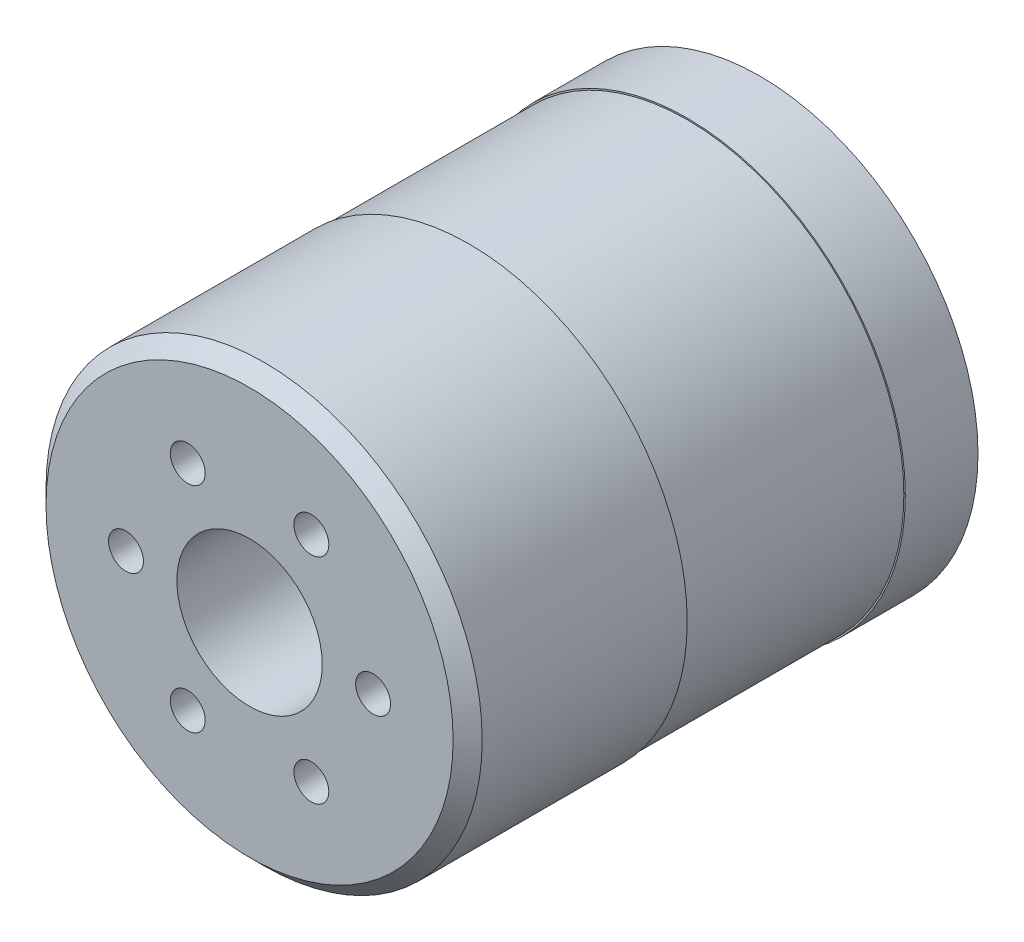
ISO-10303-21;
HEADER;
FILE_DESCRIPTION(('STEP AP214'),'2;1');
FILE_NAME('part.step','',(''),(''),'','','');
FILE_SCHEMA(('AUTOMOTIVE_DESIGN { 1 0 10303 214 1 1 1 1 }'));
ENDSEC;
DATA;
#1=APPLICATION_CONTEXT('core data for automotive mechanical design processes');
#2=APPLICATION_PROTOCOL_DEFINITION('international standard','automotive_design',2000,#1);
#3=PRODUCT_CONTEXT('',#1,'mechanical');
#4=PRODUCT('Part','Part','',(#3));
#5=PRODUCT_RELATED_PRODUCT_CATEGORY('part','',(#4));
#6=PRODUCT_DEFINITION_FORMATION('','',#4);
#7=PRODUCT_DEFINITION_CONTEXT('part definition',#1,'design');
#8=PRODUCT_DEFINITION('design','',#6,#7);
#9=PRODUCT_DEFINITION_SHAPE('','',#8);
#10=(LENGTH_UNIT() NAMED_UNIT(*) SI_UNIT(.MILLI.,.METRE.));
#11=(NAMED_UNIT(*) PLANE_ANGLE_UNIT() SI_UNIT($,.RADIAN.));
#12=(NAMED_UNIT(*) SI_UNIT($,.STERADIAN.) SOLID_ANGLE_UNIT());
#13=UNCERTAINTY_MEASURE_WITH_UNIT(LENGTH_MEASURE(1.E-05),#10,'distance_accuracy_value','');
#14=(GEOMETRIC_REPRESENTATION_CONTEXT(3) GLOBAL_UNCERTAINTY_ASSIGNED_CONTEXT((#13)) GLOBAL_UNIT_ASSIGNED_CONTEXT((#10,
#11,#12)) REPRESENTATION_CONTEXT('',''));
#15=CARTESIAN_POINT('',(0.,0.,0.));
#16=DIRECTION('',(0.,0.,1.));
#17=DIRECTION('',(1.,0.,0.));
#18=AXIS2_PLACEMENT_3D('',#15,#16,#17);
#19=CARTESIAN_POINT('',(0.,0.,0.));
#20=DIRECTION('',(0.,0.,1.));
#21=DIRECTION('',(1.,0.,0.));
#22=AXIS2_PLACEMENT_3D('',#19,#20,#21);
#23=PLANE('',#22);
#24=CARTESIAN_POINT('',(-13.,0.,0.));
#25=DIRECTION('',(0.,0.,-1.));
#26=DIRECTION('',(-1.,0.,0.));
#27=AXIS2_PLACEMENT_3D('',#24,#25,#26);
#28=CIRCLE('',#27,1.25);
#29=CARTESIAN_POINT('',(-14.25,0.,0.));
#30=VERTEX_POINT('',#29);
#31=EDGE_CURVE('E128',#30,#30,#28,.T.);
#32=ORIENTED_EDGE('',*,*,#31,.F.);
#33=EDGE_LOOP('',(#32));
#34=FACE_BOUND('',#33,.T.);
#35=CARTESIAN_POINT('',(0.,13.,0.));
#36=DIRECTION('',(0.,0.,-1.));
#37=DIRECTION('',(-1.,0.,0.));
#38=AXIS2_PLACEMENT_3D('',#35,#36,#37);
#39=CIRCLE('',#38,1.25);
#40=CARTESIAN_POINT('',(-1.25,13.,0.));
#41=VERTEX_POINT('',#40);
#42=EDGE_CURVE('E134',#41,#41,#39,.T.);
#43=ORIENTED_EDGE('',*,*,#42,.F.);
#44=EDGE_LOOP('',(#43));
#45=FACE_BOUND('',#44,.T.);
#46=CARTESIAN_POINT('',(13.,0.,0.));
#47=DIRECTION('',(0.,0.,-1.));
#48=DIRECTION('',(-1.,0.,0.));
#49=AXIS2_PLACEMENT_3D('',#46,#47,#48);
#50=CIRCLE('',#49,1.25);
#51=CARTESIAN_POINT('',(11.75,0.,0.));
#52=VERTEX_POINT('',#51);
#53=EDGE_CURVE('E140',#52,#52,#50,.T.);
#54=ORIENTED_EDGE('',*,*,#53,.F.);
#55=EDGE_LOOP('',(#54));
#56=FACE_BOUND('',#55,.T.);
#57=CARTESIAN_POINT('',(0.,-13.,0.));
#58=DIRECTION('',(0.,0.,-1.));
#59=DIRECTION('',(-1.,0.,0.));
#60=AXIS2_PLACEMENT_3D('',#57,#58,#59);
#61=CIRCLE('',#60,1.25);
#62=CARTESIAN_POINT('',(-1.25,-13.,0.));
#63=VERTEX_POINT('',#62);
#64=EDGE_CURVE('E146',#63,#63,#61,.T.);
#65=ORIENTED_EDGE('',*,*,#64,.F.);
#66=EDGE_LOOP('',(#65));
#67=FACE_BOUND('',#66,.T.);
#68=CARTESIAN_POINT('',(0.,0.,0.));
#69=DIRECTION('',(0.,0.,1.));
#70=DIRECTION('',(1.,0.,0.));
#71=AXIS2_PLACEMENT_3D('',#68,#69,#70);
#72=CIRCLE('',#71,9.);
#73=CARTESIAN_POINT('',(9.,0.,0.));
#74=VERTEX_POINT('',#73);
#75=EDGE_CURVE('E176',#74,#74,#72,.F.);
#76=ORIENTED_EDGE('',*,*,#75,.F.);
#77=EDGE_LOOP('',(#76));
#78=FACE_BOUND('',#77,.T.);
#79=CARTESIAN_POINT('',(0.,0.,0.));
#80=DIRECTION('',(0.,0.,-1.));
#81=DIRECTION('',(-1.,0.,0.));
#82=AXIS2_PLACEMENT_3D('',#79,#80,#81);
#83=CIRCLE('',#82,15.);
#84=CARTESIAN_POINT('',(-15.,0.,0.));
#85=VERTEX_POINT('',#84);
#86=EDGE_CURVE('E149',#85,#85,#83,.T.);
#87=ORIENTED_EDGE('',*,*,#86,.T.);
#88=EDGE_LOOP('',(#87));
#89=FACE_BOUND('',#88,.T.);
#90=ADVANCED_FACE('F34',(#34,#45,#56,#67,#78,#89),#23,.F.);
#91=CARTESIAN_POINT('',(0.,0.,-4.5));
#92=DIRECTION('',(0.,0.,-1.));
#93=DIRECTION('',(-1.,0.,0.));
#94=AXIS2_PLACEMENT_3D('',#91,#92,#93);
#95=PLANE('',#94);
#96=CARTESIAN_POINT('',(0.,0.,-4.5));
#97=DIRECTION('',(0.,0.,-1.));
#98=DIRECTION('',(-1.,0.,0.));
#99=AXIS2_PLACEMENT_3D('',#96,#97,#98);
#100=CIRCLE('',#99,5.);
#101=CARTESIAN_POINT('',(-5.,0.,-4.5));
#102=VERTEX_POINT('',#101);
#103=EDGE_CURVE('E168',#102,#102,#100,.T.);
#104=ORIENTED_EDGE('',*,*,#103,.T.);
#105=EDGE_LOOP('',(#104));
#106=FACE_BOUND('',#105,.T.);
#107=CARTESIAN_POINT('',(0.,0.,-4.5));
#108=DIRECTION('',(0.,0.,-1.));
#109=DIRECTION('',(-1.,0.,0.));
#110=AXIS2_PLACEMENT_3D('',#107,#108,#109);
#111=CIRCLE('',#110,4.);
#112=CARTESIAN_POINT('',(-4.,0.,-4.5));
#113=VERTEX_POINT('',#112);
#114=EDGE_CURVE('E164',#113,#113,#111,.T.);
#115=ORIENTED_EDGE('',*,*,#114,.F.);
#116=EDGE_LOOP('',(#115));
#117=FACE_BOUND('',#116,.T.);
#118=ADVANCED_FACE('F198',(#106,#117),#95,.T.);
#119=CARTESIAN_POINT('',(0.,0.,-4.));
#120=DIRECTION('',(0.,0.,-1.));
#121=DIRECTION('',(-1.,0.,0.));
#122=AXIS2_PLACEMENT_3D('',#119,#120,#121);
#123=PLANE('',#122);
#124=CARTESIAN_POINT('',(0.,0.,-4.));
#125=DIRECTION('',(0.,0.,-1.));
#126=DIRECTION('',(-1.,0.,0.));
#127=AXIS2_PLACEMENT_3D('',#124,#125,#126);
#128=CIRCLE('',#127,9.);
#129=CARTESIAN_POINT('',(-9.,0.,-4.));
#130=VERTEX_POINT('',#129);
#131=EDGE_CURVE('E171',#130,#130,#128,.T.);
#132=ORIENTED_EDGE('',*,*,#131,.T.);
#133=EDGE_LOOP('',(#132));
#134=FACE_BOUND('',#133,.T.);
#135=CARTESIAN_POINT('',(0.,0.,-4.));
#136=DIRECTION('',(0.,0.,-1.));
#137=DIRECTION('',(-1.,0.,0.));
#138=AXIS2_PLACEMENT_3D('',#135,#136,#137);
#139=CIRCLE('',#138,5.);
#140=CARTESIAN_POINT('',(-5.,0.,-4.));
#141=VERTEX_POINT('',#140);
#142=EDGE_CURVE('E167',#141,#141,#139,.T.);
#143=ORIENTED_EDGE('',*,*,#142,.F.);
#144=EDGE_LOOP('',(#143));
#145=FACE_BOUND('',#144,.T.);
#146=ADVANCED_FACE('F204',(#134,#145),#123,.T.);
#147=CARTESIAN_POINT('',(0.,0.,-4.));
#148=DIRECTION('',(0.,0.,1.));
#149=DIRECTION('',(1.,0.,0.));
#150=AXIS2_PLACEMENT_3D('',#147,#148,#149);
#151=CYLINDRICAL_SURFACE('',#150,9.);
#152=ORIENTED_EDGE('',*,*,#131,.F.);
#153=EDGE_LOOP('',(#152));
#154=FACE_BOUND('',#153,.T.);
#155=ORIENTED_EDGE('',*,*,#75,.T.);
#156=EDGE_LOOP('',(#155));
#157=FACE_BOUND('',#156,.T.);
#158=ADVANCED_FACE('F210',(#154,#157),#151,.T.);
#159=CARTESIAN_POINT('',(0.,0.,-4.5));
#160=DIRECTION('',(0.,0.,1.));
#161=DIRECTION('',(1.,0.,0.));
#162=AXIS2_PLACEMENT_3D('',#159,#160,#161);
#163=CYLINDRICAL_SURFACE('',#162,5.);
#164=ORIENTED_EDGE('',*,*,#103,.F.);
#165=EDGE_LOOP('',(#164));
#166=FACE_BOUND('',#165,.T.);
#167=ORIENTED_EDGE('',*,*,#142,.T.);
#168=EDGE_LOOP('',(#167));
#169=FACE_BOUND('',#168,.T.);
#170=ADVANCED_FACE('F213',(#166,#169),#163,.T.);
#171=CARTESIAN_POINT('',(0.,0.,-4.501));
#172=DIRECTION('',(0.,0.,1.));
#173=DIRECTION('',(1.,0.,0.));
#174=AXIS2_PLACEMENT_3D('',#171,#172,#173);
#175=CYLINDRICAL_SURFACE('',#174,4.);
#176=ORIENTED_EDGE('',*,*,#114,.T.);
#177=EDGE_LOOP('',(#176));
#178=FACE_BOUND('',#177,.T.);
#179=CARTESIAN_POINT('',(0.,0.,0.));
#180=DIRECTION('',(0.,0.,-1.));
#181=DIRECTION('',(-1.,0.,0.));
#182=AXIS2_PLACEMENT_3D('',#179,#180,#181);
#183=CIRCLE('',#182,4.);
#184=CARTESIAN_POINT('',(-4.,0.,0.));
#185=VERTEX_POINT('',#184);
#186=EDGE_CURVE('E161',#185,#185,#183,.T.);
#187=ORIENTED_EDGE('',*,*,#186,.F.);
#188=EDGE_LOOP('',(#187));
#189=FACE_BOUND('',#188,.T.);
#190=ADVANCED_FACE('F219',(#178,#189),#175,.F.);
#191=CARTESIAN_POINT('',(0.,0.,0.));
#192=DIRECTION('',(0.,0.,-1.));
#193=DIRECTION('',(-1.,0.,0.));
#194=AXIS2_PLACEMENT_3D('',#191,#192,#193);
#195=PLANE('',#194);
#196=ORIENTED_EDGE('',*,*,#186,.T.);
#197=EDGE_LOOP('',(#196));
#198=FACE_BOUND('',#197,.T.);
#199=ADVANCED_FACE('F224',(#198),#195,.T.);
#200=CARTESIAN_POINT('',(0.,0.,5.));
#201=DIRECTION('',(0.,0.,-1.));
#202=DIRECTION('',(-1.,0.,0.));
#203=AXIS2_PLACEMENT_3D('',#200,#201,#202);
#204=CYLINDRICAL_SURFACE('',#203,15.);
#205=CARTESIAN_POINT('',(0.,0.,5.));
#206=DIRECTION('',(0.,0.,-1.));
#207=DIRECTION('',(-1.,0.,0.));
#208=AXIS2_PLACEMENT_3D('',#205,#206,#207);
#209=CIRCLE('',#208,15.);
#210=CARTESIAN_POINT('',(-15.,0.,5.));
#211=VERTEX_POINT('',#210);
#212=EDGE_CURVE('E150',#211,#211,#209,.T.);
#213=ORIENTED_EDGE('',*,*,#212,.T.);
#214=EDGE_LOOP('',(#213));
#215=FACE_BOUND('',#214,.T.);
#216=ORIENTED_EDGE('',*,*,#86,.F.);
#217=EDGE_LOOP('',(#216));
#218=FACE_BOUND('',#217,.T.);
#219=ADVANCED_FACE('F228',(#215,#218),#204,.T.);
#220=CARTESIAN_POINT('',(0.,0.,5.));
#221=DIRECTION('',(0.,0.,-1.));
#222=DIRECTION('',(-1.,0.,0.));
#223=AXIS2_PLACEMENT_3D('',#220,#221,#222);
#224=PLANE('',#223);
#225=CARTESIAN_POINT('',(0.,0.,5.));
#226=DIRECTION('',(0.,0.,-1.));
#227=DIRECTION('',(-1.,0.,0.));
#228=AXIS2_PLACEMENT_3D('',#225,#226,#227);
#229=CIRCLE('',#228,14.9);
#230=CARTESIAN_POINT('',(-14.9,0.,5.));
#231=VERTEX_POINT('',#230);
#232=EDGE_CURVE('E38',#231,#231,#229,.F.);
#233=ORIENTED_EDGE('',*,*,#232,.F.);
#234=EDGE_LOOP('',(#233));
#235=FACE_BOUND('',#234,.T.);
#236=ORIENTED_EDGE('',*,*,#212,.F.);
#237=EDGE_LOOP('',(#236));
#238=FACE_BOUND('',#237,.T.);
#239=ADVANCED_FACE('F193',(#235,#238),#224,.F.);
#240=CARTESIAN_POINT('',(0.,0.,35.1));
#241=DIRECTION('',(0.,0.,1.));
#242=DIRECTION('',(1.,0.,0.));
#243=AXIS2_PLACEMENT_3D('',#240,#241,#242);
#244=PLANE('',#243);
#245=CARTESIAN_POINT('',(4.25000000000004,-7.36121593216771,35.1));
#246=DIRECTION('',(0.,0.,1.));
#247=DIRECTION('',(1.,0.,0.));
#248=AXIS2_PLACEMENT_3D('',#245,#246,#247);
#249=CIRCLE('',#248,1.19999999999999);
#250=CARTESIAN_POINT('',(5.45000000000003,-7.36121593216771,35.1));
#251=VERTEX_POINT('',#250);
#252=EDGE_CURVE('E85',#251,#251,#249,.T.);
#253=ORIENTED_EDGE('',*,*,#252,.F.);
#254=EDGE_LOOP('',(#253));
#255=FACE_BOUND('',#254,.T.);
#256=CARTESIAN_POINT('',(-4.24999999999998,-7.36121593216774,35.1));
#257=DIRECTION('',(0.,0.,1.));
#258=DIRECTION('',(1.,0.,0.));
#259=AXIS2_PLACEMENT_3D('',#256,#257,#258);
#260=CIRCLE('',#259,1.19999999999999);
#261=CARTESIAN_POINT('',(-3.04999999999999,-7.36121593216774,35.1));
#262=VERTEX_POINT('',#261);
#263=EDGE_CURVE('E84',#262,#262,#260,.T.);
#264=ORIENTED_EDGE('',*,*,#263,.F.);
#265=EDGE_LOOP('',(#264));
#266=FACE_BOUND('',#265,.T.);
#267=CARTESIAN_POINT('',(-8.5,0.,35.1));
#268=DIRECTION('',(0.,0.,1.));
#269=DIRECTION('',(1.,0.,0.));
#270=AXIS2_PLACEMENT_3D('',#267,#268,#269);
#271=CIRCLE('',#270,1.19999999999999);
#272=CARTESIAN_POINT('',(-7.30000000000001,0.,35.1));
#273=VERTEX_POINT('',#272);
#274=EDGE_CURVE('E95',#273,#273,#271,.T.);
#275=ORIENTED_EDGE('',*,*,#274,.F.);
#276=EDGE_LOOP('',(#275));
#277=FACE_BOUND('',#276,.T.);
#278=CARTESIAN_POINT('',(-4.25000000000004,7.36121593216771,35.1));
#279=DIRECTION('',(0.,0.,1.));
#280=DIRECTION('',(1.,0.,0.));
#281=AXIS2_PLACEMENT_3D('',#278,#279,#280);
#282=CIRCLE('',#281,1.19999999999999);
#283=CARTESIAN_POINT('',(-3.05000000000005,7.36121593216771,35.1));
#284=VERTEX_POINT('',#283);
#285=EDGE_CURVE('E101',#284,#284,#282,.T.);
#286=ORIENTED_EDGE('',*,*,#285,.F.);
#287=EDGE_LOOP('',(#286));
#288=FACE_BOUND('',#287,.T.);
#289=CARTESIAN_POINT('',(4.24999999999998,7.36121593216774,35.1));
#290=DIRECTION('',(0.,0.,1.));
#291=DIRECTION('',(1.,0.,0.));
#292=AXIS2_PLACEMENT_3D('',#289,#290,#291);
#293=CIRCLE('',#292,1.19999999999999);
#294=CARTESIAN_POINT('',(5.44999999999997,7.36121593216774,35.1));
#295=VERTEX_POINT('',#294);
#296=EDGE_CURVE('E107',#295,#295,#293,.T.);
#297=ORIENTED_EDGE('',*,*,#296,.F.);
#298=EDGE_LOOP('',(#297));
#299=FACE_BOUND('',#298,.T.);
#300=CARTESIAN_POINT('',(8.5,0.,35.1));
#301=DIRECTION('',(0.,0.,1.));
#302=DIRECTION('',(1.,0.,0.));
#303=AXIS2_PLACEMENT_3D('',#300,#301,#302);
#304=CIRCLE('',#303,1.19999999999999);
#305=CARTESIAN_POINT('',(9.69999999999999,0.,35.1));
#306=VERTEX_POINT('',#305);
#307=EDGE_CURVE('E113',#306,#306,#304,.T.);
#308=ORIENTED_EDGE('',*,*,#307,.F.);
#309=EDGE_LOOP('',(#308));
#310=FACE_BOUND('',#309,.T.);
#311=CARTESIAN_POINT('',(0.,0.,35.1));
#312=DIRECTION('',(0.,0.,1.));
#313=DIRECTION('',(1.,0.,0.));
#314=AXIS2_PLACEMENT_3D('',#311,#312,#313);
#315=CIRCLE('',#314,5.);
#316=CARTESIAN_POINT('',(5.,0.,35.1));
#317=VERTEX_POINT('',#316);
#318=EDGE_CURVE('E119',#317,#317,#315,.T.);
#319=ORIENTED_EDGE('',*,*,#318,.F.);
#320=EDGE_LOOP('',(#319));
#321=FACE_BOUND('',#320,.T.);
#322=CARTESIAN_POINT('',(0.,0.,35.1));
#323=DIRECTION('',(0.,0.,1.));
#324=DIRECTION('',(1.,0.,0.));
#325=AXIS2_PLACEMENT_3D('',#322,#323,#324);
#326=CIRCLE('',#325,14.);
#327=CARTESIAN_POINT('',(14.,0.,35.1));
#328=VERTEX_POINT('',#327);
#329=EDGE_CURVE('E43',#328,#328,#326,.T.);
#330=ORIENTED_EDGE('',*,*,#329,.T.);
#331=EDGE_LOOP('',(#330));
#332=FACE_BOUND('',#331,.T.);
#333=ADVANCED_FACE('F182',(#255,#266,#277,#288,#299,#310,#321,#332),#244,.T.);
#334=CARTESIAN_POINT('',(0.,0.,35.1));
#335=DIRECTION('',(0.,0.,-1.));
#336=DIRECTION('',(-1.,0.,0.));
#337=AXIS2_PLACEMENT_3D('',#334,#335,#336);
#338=CONICAL_SURFACE('',#337,14.,0.785398163397446);
#339=CARTESIAN_POINT('',(0.,0.,34.1));
#340=DIRECTION('',(0.,0.,1.));
#341=DIRECTION('',(1.,0.,0.));
#342=AXIS2_PLACEMENT_3D('',#339,#340,#341);
#343=CIRCLE('',#342,15.);
#344=CARTESIAN_POINT('',(15.,0.,34.1));
#345=VERTEX_POINT('',#344);
#346=EDGE_CURVE('E11',#345,#345,#343,.F.);
#347=ORIENTED_EDGE('',*,*,#346,.F.);
#348=EDGE_LOOP('',(#347));
#349=FACE_BOUND('',#348,.T.);
#350=ORIENTED_EDGE('',*,*,#329,.F.);
#351=EDGE_LOOP('',(#350));
#352=FACE_BOUND('',#351,.T.);
#353=ADVANCED_FACE('F36',(#349,#352),#338,.T.);
#354=CARTESIAN_POINT('',(0.,0.,35.1));
#355=DIRECTION('',(0.,0.,-1.));
#356=DIRECTION('',(-1.,0.,0.));
#357=AXIS2_PLACEMENT_3D('',#354,#355,#356);
#358=CYLINDRICAL_SURFACE('',#357,15.);
#359=ORIENTED_EDGE('',*,*,#346,.T.);
#360=EDGE_LOOP('',(#359));
#361=FACE_BOUND('',#360,.T.);
#362=CARTESIAN_POINT('',(0.,0.,20.));
#363=DIRECTION('',(0.,0.,-1.));
#364=DIRECTION('',(-1.,0.,0.));
#365=AXIS2_PLACEMENT_3D('',#362,#363,#364);
#366=CIRCLE('',#365,15.);
#367=CARTESIAN_POINT('',(-15.,0.,20.));
#368=VERTEX_POINT('',#367);
#369=EDGE_CURVE('E158',#368,#368,#366,.T.);
#370=ORIENTED_EDGE('',*,*,#369,.F.);
#371=EDGE_LOOP('',(#370));
#372=FACE_BOUND('',#371,.T.);
#373=ADVANCED_FACE('F185',(#361,#372),#358,.T.);
#374=CARTESIAN_POINT('',(0.,0.,20.));
#375=DIRECTION('',(0.,0.,-1.));
#376=DIRECTION('',(-1.,0.,0.));
#377=AXIS2_PLACEMENT_3D('',#374,#375,#376);
#378=PLANE('',#377);
#379=CARTESIAN_POINT('',(0.,0.,20.));
#380=DIRECTION('',(0.,0.,-1.));
#381=DIRECTION('',(-1.,0.,0.));
#382=AXIS2_PLACEMENT_3D('',#379,#380,#381);
#383=CIRCLE('',#382,14.9);
#384=CARTESIAN_POINT('',(-14.9,0.,20.));
#385=VERTEX_POINT('',#384);
#386=EDGE_CURVE('E155',#385,#385,#383,.T.);
#387=ORIENTED_EDGE('',*,*,#386,.F.);
#388=EDGE_LOOP('',(#387));
#389=FACE_BOUND('',#388,.T.);
#390=ORIENTED_EDGE('',*,*,#369,.T.);
#391=EDGE_LOOP('',(#390));
#392=FACE_BOUND('',#391,.T.);
#393=ADVANCED_FACE('F191',(#389,#392),#378,.T.);
#394=CARTESIAN_POINT('',(0.,0.,20.));
#395=DIRECTION('',(0.,0.,-1.));
#396=DIRECTION('',(-1.,0.,0.));
#397=AXIS2_PLACEMENT_3D('',#394,#395,#396);
#398=CYLINDRICAL_SURFACE('',#397,14.9);
#399=ORIENTED_EDGE('',*,*,#386,.T.);
#400=EDGE_LOOP('',(#399));
#401=FACE_BOUND('',#400,.T.);
#402=ORIENTED_EDGE('',*,*,#232,.T.);
#403=EDGE_LOOP('',(#402));
#404=FACE_BOUND('',#403,.T.);
#405=ADVANCED_FACE('F232',(#401,#404),#398,.T.);
#406=CARTESIAN_POINT('',(0.,-13.,0.));
#407=DIRECTION('',(0.,0.,-1.));
#408=DIRECTION('',(-1.,0.,0.));
#409=AXIS2_PLACEMENT_3D('',#406,#407,#408);
#410=CYLINDRICAL_SURFACE('',#409,1.25);
#411=CARTESIAN_POINT('',(0.,-13.,4.5));
#412=DIRECTION('',(0.,0.,-1.));
#413=DIRECTION('',(-1.,0.,0.));
#414=AXIS2_PLACEMENT_3D('',#411,#412,#413);
#415=CIRCLE('',#414,1.25);
#416=CARTESIAN_POINT('',(-1.25,-13.,4.5));
#417=VERTEX_POINT('',#416);
#418=EDGE_CURVE('E143',#417,#417,#415,.T.);
#419=ORIENTED_EDGE('',*,*,#418,.F.);
#420=EDGE_LOOP('',(#419));
#421=FACE_BOUND('',#420,.T.);
#422=ORIENTED_EDGE('',*,*,#64,.T.);
#423=EDGE_LOOP('',(#422));
#424=FACE_BOUND('',#423,.T.);
#425=ADVANCED_FACE('F236',(#421,#424),#410,.F.);
#426=CARTESIAN_POINT('',(0.,-13.,4.5));
#427=DIRECTION('',(0.,0.,-1.));
#428=DIRECTION('',(-1.,0.,0.));
#429=AXIS2_PLACEMENT_3D('',#426,#427,#428);
#430=CONICAL_SURFACE('',#429,1.25,1.02974425867665);
#431=CARTESIAN_POINT('',(0.,-13.,5.25107577378445));
#432=VERTEX_POINT('',#431);
#433=VERTEX_LOOP('',#432);
#434=FACE_BOUND('',#433,.T.);
#435=ORIENTED_EDGE('',*,*,#418,.T.);
#436=EDGE_LOOP('',(#435));
#437=FACE_BOUND('',#436,.T.);
#438=ADVANCED_FACE('F246',(#434,#437),#430,.F.);
#439=CARTESIAN_POINT('',(13.,0.,0.));
#440=DIRECTION('',(0.,0.,-1.));
#441=DIRECTION('',(-1.,0.,0.));
#442=AXIS2_PLACEMENT_3D('',#439,#440,#441);
#443=CYLINDRICAL_SURFACE('',#442,1.25);
#444=CARTESIAN_POINT('',(13.,0.,4.5));
#445=DIRECTION('',(0.,0.,-1.));
#446=DIRECTION('',(-1.,0.,0.));
#447=AXIS2_PLACEMENT_3D('',#444,#445,#446);
#448=CIRCLE('',#447,1.25);
#449=CARTESIAN_POINT('',(11.75,0.,4.5));
#450=VERTEX_POINT('',#449);
#451=EDGE_CURVE('E137',#450,#450,#448,.T.);
#452=ORIENTED_EDGE('',*,*,#451,.F.);
#453=EDGE_LOOP('',(#452));
#454=FACE_BOUND('',#453,.T.);
#455=ORIENTED_EDGE('',*,*,#53,.T.);
#456=EDGE_LOOP('',(#455));
#457=FACE_BOUND('',#456,.T.);
#458=ADVANCED_FACE('F250',(#454,#457),#443,.F.);
#459=CARTESIAN_POINT('',(13.,0.,4.5));
#460=DIRECTION('',(0.,0.,-1.));
#461=DIRECTION('',(-1.,0.,0.));
#462=AXIS2_PLACEMENT_3D('',#459,#460,#461);
#463=CONICAL_SURFACE('',#462,1.25,1.02974425867665);
#464=CARTESIAN_POINT('',(13.,0.,5.25107577378445));
#465=VERTEX_POINT('',#464);
#466=VERTEX_LOOP('',#465);
#467=FACE_BOUND('',#466,.T.);
#468=ORIENTED_EDGE('',*,*,#451,.T.);
#469=EDGE_LOOP('',(#468));
#470=FACE_BOUND('',#469,.T.);
#471=ADVANCED_FACE('F253',(#467,#470),#463,.F.);
#472=CARTESIAN_POINT('',(0.,13.,0.));
#473=DIRECTION('',(0.,0.,-1.));
#474=DIRECTION('',(-1.,0.,0.));
#475=AXIS2_PLACEMENT_3D('',#472,#473,#474);
#476=CYLINDRICAL_SURFACE('',#475,1.25);
#477=CARTESIAN_POINT('',(0.,13.,4.5));
#478=DIRECTION('',(0.,0.,-1.));
#479=DIRECTION('',(-1.,0.,0.));
#480=AXIS2_PLACEMENT_3D('',#477,#478,#479);
#481=CIRCLE('',#480,1.25);
#482=CARTESIAN_POINT('',(-1.25,13.,4.5));
#483=VERTEX_POINT('',#482);
#484=EDGE_CURVE('E131',#483,#483,#481,.T.);
#485=ORIENTED_EDGE('',*,*,#484,.F.);
#486=EDGE_LOOP('',(#485));
#487=FACE_BOUND('',#486,.T.);
#488=ORIENTED_EDGE('',*,*,#42,.T.);
#489=EDGE_LOOP('',(#488));
#490=FACE_BOUND('',#489,.T.);
#491=ADVANCED_FACE('F257',(#487,#490),#476,.F.);
#492=CARTESIAN_POINT('',(0.,13.,4.5));
#493=DIRECTION('',(0.,0.,-1.));
#494=DIRECTION('',(-1.,0.,0.));
#495=AXIS2_PLACEMENT_3D('',#492,#493,#494);
#496=CONICAL_SURFACE('',#495,1.25,1.02974425867665);
#497=CARTESIAN_POINT('',(0.,13.,5.25107577378445));
#498=VERTEX_POINT('',#497);
#499=VERTEX_LOOP('',#498);
#500=FACE_BOUND('',#499,.T.);
#501=ORIENTED_EDGE('',*,*,#484,.T.);
#502=EDGE_LOOP('',(#501));
#503=FACE_BOUND('',#502,.T.);
#504=ADVANCED_FACE('F260',(#500,#503),#496,.F.);
#505=CARTESIAN_POINT('',(-13.,0.,0.));
#506=DIRECTION('',(0.,0.,-1.));
#507=DIRECTION('',(-1.,0.,0.));
#508=AXIS2_PLACEMENT_3D('',#505,#506,#507);
#509=CYLINDRICAL_SURFACE('',#508,1.25);
#510=CARTESIAN_POINT('',(-13.,0.,4.5));
#511=DIRECTION('',(0.,0.,-1.));
#512=DIRECTION('',(-1.,0.,0.));
#513=AXIS2_PLACEMENT_3D('',#510,#511,#512);
#514=CIRCLE('',#513,1.25);
#515=CARTESIAN_POINT('',(-14.25,0.,4.5));
#516=VERTEX_POINT('',#515);
#517=EDGE_CURVE('E123',#516,#516,#514,.T.);
#518=ORIENTED_EDGE('',*,*,#517,.F.);
#519=EDGE_LOOP('',(#518));
#520=FACE_BOUND('',#519,.T.);
#521=ORIENTED_EDGE('',*,*,#31,.T.);
#522=EDGE_LOOP('',(#521));
#523=FACE_BOUND('',#522,.T.);
#524=ADVANCED_FACE('F264',(#520,#523),#509,.F.);
#525=CARTESIAN_POINT('',(-13.,0.,4.5));
#526=DIRECTION('',(0.,0.,-1.));
#527=DIRECTION('',(-1.,0.,0.));
#528=AXIS2_PLACEMENT_3D('',#525,#526,#527);
#529=CONICAL_SURFACE('',#528,1.25,1.02974425867665);
#530=CARTESIAN_POINT('',(-13.,0.,5.25107577378445));
#531=VERTEX_POINT('',#530);
#532=VERTEX_LOOP('',#531);
#533=FACE_BOUND('',#532,.T.);
#534=ORIENTED_EDGE('',*,*,#517,.T.);
#535=EDGE_LOOP('',(#534));
#536=FACE_BOUND('',#535,.T.);
#537=ADVANCED_FACE('F268',(#533,#536),#529,.F.);
#538=CARTESIAN_POINT('',(0.,0.,20.1));
#539=DIRECTION('',(0.,0.,1.));
#540=DIRECTION('',(1.,0.,0.));
#541=AXIS2_PLACEMENT_3D('',#538,#539,#540);
#542=CYLINDRICAL_SURFACE('',#541,5.);
#543=CARTESIAN_POINT('',(0.,0.,20.1));
#544=DIRECTION('',(0.,0.,1.));
#545=DIRECTION('',(1.,0.,0.));
#546=AXIS2_PLACEMENT_3D('',#543,#544,#545);
#547=CIRCLE('',#546,5.);
#548=CARTESIAN_POINT('',(5.,0.,20.1));
#549=VERTEX_POINT('',#548);
#550=EDGE_CURVE('E120',#549,#549,#547,.T.);
#551=ORIENTED_EDGE('',*,*,#550,.F.);
#552=EDGE_LOOP('',(#551));
#553=FACE_BOUND('',#552,.T.);
#554=ORIENTED_EDGE('',*,*,#318,.T.);
#555=EDGE_LOOP('',(#554));
#556=FACE_BOUND('',#555,.T.);
#557=ADVANCED_FACE('F272',(#553,#556),#542,.F.);
#558=CARTESIAN_POINT('',(0.,0.,20.1));
#559=DIRECTION('',(0.,0.,1.));
#560=DIRECTION('',(1.,0.,0.));
#561=AXIS2_PLACEMENT_3D('',#558,#559,#560);
#562=PLANE('',#561);
#563=ORIENTED_EDGE('',*,*,#550,.T.);
#564=EDGE_LOOP('',(#563));
#565=FACE_BOUND('',#564,.T.);
#566=ADVANCED_FACE('F276',(#565),#562,.T.);
#567=CARTESIAN_POINT('',(8.5,0.,32.1));
#568=DIRECTION('',(0.,0.,1.));
#569=DIRECTION('',(1.,0.,0.));
#570=AXIS2_PLACEMENT_3D('',#567,#568,#569);
#571=CONICAL_SURFACE('',#570,1.2,1.02974425867666);
#572=CARTESIAN_POINT('',(8.5,0.,31.3789672571669));
#573=VERTEX_POINT('',#572);
#574=VERTEX_LOOP('',#573);
#575=FACE_BOUND('',#574,.T.);
#576=CARTESIAN_POINT('',(8.5,0.,32.1));
#577=DIRECTION('',(0.,0.,1.));
#578=DIRECTION('',(1.,0.,0.));
#579=AXIS2_PLACEMENT_3D('',#576,#577,#578);
#580=CIRCLE('',#579,1.2);
#581=CARTESIAN_POINT('',(9.7,0.,32.1));
#582=VERTEX_POINT('',#581);
#583=EDGE_CURVE('E116',#582,#582,#580,.T.);
#584=ORIENTED_EDGE('',*,*,#583,.T.);
#585=EDGE_LOOP('',(#584));
#586=FACE_BOUND('',#585,.T.);
#587=ADVANCED_FACE('F280',(#575,#586),#571,.F.);
#588=CARTESIAN_POINT('',(8.5,0.,35.1));
#589=DIRECTION('',(0.,0.,1.));
#590=DIRECTION('',(1.,0.,0.));
#591=AXIS2_PLACEMENT_3D('',#588,#589,#590);
#592=CYLINDRICAL_SURFACE('',#591,1.19999999999999);
#593=ORIENTED_EDGE('',*,*,#583,.F.);
#594=EDGE_LOOP('',(#593));
#595=FACE_BOUND('',#594,.T.);
#596=ORIENTED_EDGE('',*,*,#307,.T.);
#597=EDGE_LOOP('',(#596));
#598=FACE_BOUND('',#597,.T.);
#599=ADVANCED_FACE('F284',(#595,#598),#592,.F.);
#600=CARTESIAN_POINT('',(4.24999999999998,7.36121593216774,32.1));
#601=DIRECTION('',(0.,0.,1.));
#602=DIRECTION('',(1.,0.,0.));
#603=AXIS2_PLACEMENT_3D('',#600,#601,#602);
#604=CONICAL_SURFACE('',#603,1.2,1.02974425867666);
#605=CARTESIAN_POINT('',(4.24999999999998,7.36121593216774,31.3789672571669));
#606=VERTEX_POINT('',#605);
#607=VERTEX_LOOP('',#606);
#608=FACE_BOUND('',#607,.T.);
#609=CARTESIAN_POINT('',(4.24999999999998,7.36121593216774,32.1));
#610=DIRECTION('',(0.,0.,1.));
#611=DIRECTION('',(1.,0.,0.));
#612=AXIS2_PLACEMENT_3D('',#609,#610,#611);
#613=CIRCLE('',#612,1.2);
#614=CARTESIAN_POINT('',(5.44999999999998,7.36121593216774,32.1));
#615=VERTEX_POINT('',#614);
#616=EDGE_CURVE('E110',#615,#615,#613,.T.);
#617=ORIENTED_EDGE('',*,*,#616,.T.);
#618=EDGE_LOOP('',(#617));
#619=FACE_BOUND('',#618,.T.);
#620=ADVANCED_FACE('F288',(#608,#619),#604,.F.);
#621=CARTESIAN_POINT('',(4.24999999999998,7.36121593216774,35.1));
#622=DIRECTION('',(0.,0.,1.));
#623=DIRECTION('',(1.,0.,0.));
#624=AXIS2_PLACEMENT_3D('',#621,#622,#623);
#625=CYLINDRICAL_SURFACE('',#624,1.19999999999999);
#626=ORIENTED_EDGE('',*,*,#616,.F.);
#627=EDGE_LOOP('',(#626));
#628=FACE_BOUND('',#627,.T.);
#629=ORIENTED_EDGE('',*,*,#296,.T.);
#630=EDGE_LOOP('',(#629));
#631=FACE_BOUND('',#630,.T.);
#632=ADVANCED_FACE('F292',(#628,#631),#625,.F.);
#633=CARTESIAN_POINT('',(-4.25000000000004,7.36121593216771,32.1));
#634=DIRECTION('',(0.,0.,1.));
#635=DIRECTION('',(1.,0.,0.));
#636=AXIS2_PLACEMENT_3D('',#633,#634,#635);
#637=CONICAL_SURFACE('',#636,1.2,1.02974425867666);
#638=CARTESIAN_POINT('',(-4.25000000000004,7.36121593216771,31.3789672571669));
#639=VERTEX_POINT('',#638);
#640=VERTEX_LOOP('',#639);
#641=FACE_BOUND('',#640,.T.);
#642=CARTESIAN_POINT('',(-4.25000000000004,7.36121593216771,32.1));
#643=DIRECTION('',(0.,0.,1.));
#644=DIRECTION('',(1.,0.,0.));
#645=AXIS2_PLACEMENT_3D('',#642,#643,#644);
#646=CIRCLE('',#645,1.2);
#647=CARTESIAN_POINT('',(-3.05000000000004,7.36121593216771,32.1));
#648=VERTEX_POINT('',#647);
#649=EDGE_CURVE('E104',#648,#648,#646,.T.);
#650=ORIENTED_EDGE('',*,*,#649,.T.);
#651=EDGE_LOOP('',(#650));
#652=FACE_BOUND('',#651,.T.);
#653=ADVANCED_FACE('F296',(#641,#652),#637,.F.);
#654=CARTESIAN_POINT('',(-4.25000000000004,7.36121593216771,35.1));
#655=DIRECTION('',(0.,0.,1.));
#656=DIRECTION('',(1.,0.,0.));
#657=AXIS2_PLACEMENT_3D('',#654,#655,#656);
#658=CYLINDRICAL_SURFACE('',#657,1.19999999999999);
#659=ORIENTED_EDGE('',*,*,#649,.F.);
#660=EDGE_LOOP('',(#659));
#661=FACE_BOUND('',#660,.T.);
#662=ORIENTED_EDGE('',*,*,#285,.T.);
#663=EDGE_LOOP('',(#662));
#664=FACE_BOUND('',#663,.T.);
#665=ADVANCED_FACE('F300',(#661,#664),#658,.F.);
#666=CARTESIAN_POINT('',(-8.5,0.,32.1));
#667=DIRECTION('',(0.,0.,1.));
#668=DIRECTION('',(1.,0.,0.));
#669=AXIS2_PLACEMENT_3D('',#666,#667,#668);
#670=CONICAL_SURFACE('',#669,1.2,1.02974425867666);
#671=CARTESIAN_POINT('',(-8.5,0.,31.3789672571669));
#672=VERTEX_POINT('',#671);
#673=VERTEX_LOOP('',#672);
#674=FACE_BOUND('',#673,.T.);
#675=CARTESIAN_POINT('',(-8.5,0.,32.1));
#676=DIRECTION('',(0.,0.,1.));
#677=DIRECTION('',(1.,0.,0.));
#678=AXIS2_PLACEMENT_3D('',#675,#676,#677);
#679=CIRCLE('',#678,1.2);
#680=CARTESIAN_POINT('',(-7.3,0.,32.1));
#681=VERTEX_POINT('',#680);
#682=EDGE_CURVE('E98',#681,#681,#679,.T.);
#683=ORIENTED_EDGE('',*,*,#682,.T.);
#684=EDGE_LOOP('',(#683));
#685=FACE_BOUND('',#684,.T.);
#686=ADVANCED_FACE('F304',(#674,#685),#670,.F.);
#687=CARTESIAN_POINT('',(-8.5,0.,35.1));
#688=DIRECTION('',(0.,0.,1.));
#689=DIRECTION('',(1.,0.,0.));
#690=AXIS2_PLACEMENT_3D('',#687,#688,#689);
#691=CYLINDRICAL_SURFACE('',#690,1.19999999999999);
#692=ORIENTED_EDGE('',*,*,#682,.F.);
#693=EDGE_LOOP('',(#692));
#694=FACE_BOUND('',#693,.T.);
#695=ORIENTED_EDGE('',*,*,#274,.T.);
#696=EDGE_LOOP('',(#695));
#697=FACE_BOUND('',#696,.T.);
#698=ADVANCED_FACE('F308',(#694,#697),#691,.F.);
#699=CARTESIAN_POINT('',(-4.24999999999998,-7.36121593216774,32.1));
#700=DIRECTION('',(0.,0.,1.));
#701=DIRECTION('',(1.,0.,0.));
#702=AXIS2_PLACEMENT_3D('',#699,#700,#701);
#703=CONICAL_SURFACE('',#702,1.2,1.02974425867666);
#704=CARTESIAN_POINT('',(-4.24999999999998,-7.36121593216774,31.3789672571669));
#705=VERTEX_POINT('',#704);
#706=VERTEX_LOOP('',#705);
#707=FACE_BOUND('',#706,.T.);
#708=CARTESIAN_POINT('',(-4.24999999999998,-7.36121593216774,32.1));
#709=DIRECTION('',(0.,0.,1.));
#710=DIRECTION('',(1.,0.,0.));
#711=AXIS2_PLACEMENT_3D('',#708,#709,#710);
#712=CIRCLE('',#711,1.2);
#713=CARTESIAN_POINT('',(-3.04999999999998,-7.36121593216774,32.1));
#714=VERTEX_POINT('',#713);
#715=EDGE_CURVE('E88',#714,#714,#712,.T.);
#716=ORIENTED_EDGE('',*,*,#715,.T.);
#717=EDGE_LOOP('',(#716));
#718=FACE_BOUND('',#717,.T.);
#719=ADVANCED_FACE('F312',(#707,#718),#703,.F.);
#720=CARTESIAN_POINT('',(-4.24999999999998,-7.36121593216774,35.1));
#721=DIRECTION('',(0.,0.,1.));
#722=DIRECTION('',(1.,0.,0.));
#723=AXIS2_PLACEMENT_3D('',#720,#721,#722);
#724=CYLINDRICAL_SURFACE('',#723,1.19999999999999);
#725=ORIENTED_EDGE('',*,*,#715,.F.);
#726=EDGE_LOOP('',(#725));
#727=FACE_BOUND('',#726,.T.);
#728=ORIENTED_EDGE('',*,*,#263,.T.);
#729=EDGE_LOOP('',(#728));
#730=FACE_BOUND('',#729,.T.);
#731=ADVANCED_FACE('F78',(#727,#730),#724,.F.);
#732=CARTESIAN_POINT('',(4.25000000000004,-7.36121593216771,32.1));
#733=DIRECTION('',(0.,0.,1.));
#734=DIRECTION('',(1.,0.,0.));
#735=AXIS2_PLACEMENT_3D('',#732,#733,#734);
#736=CONICAL_SURFACE('',#735,1.2,1.02974425867666);
#737=CARTESIAN_POINT('',(4.25000000000004,-7.36121593216771,31.3789672571669));
#738=VERTEX_POINT('',#737);
#739=VERTEX_LOOP('',#738);
#740=FACE_BOUND('',#739,.T.);
#741=CARTESIAN_POINT('',(4.25000000000004,-7.36121593216771,32.1));
#742=DIRECTION('',(0.,0.,1.));
#743=DIRECTION('',(1.,0.,0.));
#744=AXIS2_PLACEMENT_3D('',#741,#742,#743);
#745=CIRCLE('',#744,1.2);
#746=CARTESIAN_POINT('',(5.45000000000004,-7.36121593216771,32.1));
#747=VERTEX_POINT('',#746);
#748=EDGE_CURVE('E82',#747,#747,#745,.T.);
#749=ORIENTED_EDGE('',*,*,#748,.T.);
#750=EDGE_LOOP('',(#749));
#751=FACE_BOUND('',#750,.T.);
#752=ADVANCED_FACE('F74',(#740,#751),#736,.F.);
#753=CARTESIAN_POINT('',(4.25000000000004,-7.36121593216771,35.1));
#754=DIRECTION('',(0.,0.,1.));
#755=DIRECTION('',(1.,0.,0.));
#756=AXIS2_PLACEMENT_3D('',#753,#754,#755);
#757=CYLINDRICAL_SURFACE('',#756,1.19999999999999);
#758=ORIENTED_EDGE('',*,*,#748,.F.);
#759=EDGE_LOOP('',(#758));
#760=FACE_BOUND('',#759,.T.);
#761=ORIENTED_EDGE('',*,*,#252,.T.);
#762=EDGE_LOOP('',(#761));
#763=FACE_BOUND('',#762,.T.);
#764=ADVANCED_FACE('F77',(#760,#763),#757,.F.);
#765=CLOSED_SHELL('',(#90,#118,#146,#158,#170,#190,#199,#219,#239,#333,#353,#373,#393,#405,#425,
#438,#458,#471,#491,#504,#524,#537,#557,#566,#587,#599,#620,#632,#653,#665,#686,#698,#719,#731,
#752,#764));
#766=MANIFOLD_SOLID_BREP('B2',#765);
#767=ADVANCED_BREP_SHAPE_REPRESENTATION('',(#18,#766),#14);
#768=SHAPE_DEFINITION_REPRESENTATION(#9,#767);
ENDSEC;
END-ISO-10303-21;
